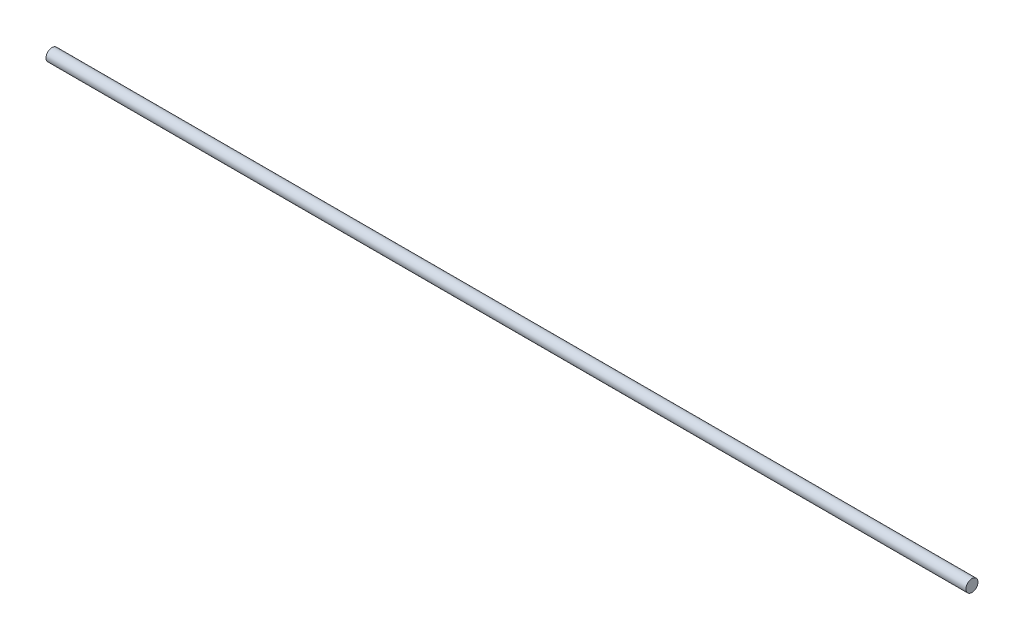
ISO-10303-21;
HEADER;
FILE_DESCRIPTION(('STEP AP214'),'2;1');
FILE_NAME('part.step','',(''),(''),'','','');
FILE_SCHEMA(('AUTOMOTIVE_DESIGN { 1 0 10303 214 1 1 1 1 }'));
ENDSEC;
DATA;
#1=APPLICATION_CONTEXT('core data for automotive mechanical design processes');
#2=APPLICATION_PROTOCOL_DEFINITION('international standard','automotive_design',2000,#1);
#3=PRODUCT_CONTEXT('',#1,'mechanical');
#4=PRODUCT('Part','Part','',(#3));
#5=PRODUCT_RELATED_PRODUCT_CATEGORY('part','',(#4));
#6=PRODUCT_DEFINITION_FORMATION('','',#4);
#7=PRODUCT_DEFINITION_CONTEXT('part definition',#1,'design');
#8=PRODUCT_DEFINITION('design','',#6,#7);
#9=PRODUCT_DEFINITION_SHAPE('','',#8);
#10=(LENGTH_UNIT() NAMED_UNIT(*) SI_UNIT(.MILLI.,.METRE.));
#11=(NAMED_UNIT(*) PLANE_ANGLE_UNIT() SI_UNIT($,.RADIAN.));
#12=(NAMED_UNIT(*) SI_UNIT($,.STERADIAN.) SOLID_ANGLE_UNIT());
#13=UNCERTAINTY_MEASURE_WITH_UNIT(LENGTH_MEASURE(1.E-05),#10,'distance_accuracy_value','');
#14=(GEOMETRIC_REPRESENTATION_CONTEXT(3) GLOBAL_UNCERTAINTY_ASSIGNED_CONTEXT((#13)) GLOBAL_UNIT_ASSIGNED_CONTEXT((#10,
#11,#12)) REPRESENTATION_CONTEXT('',''));
#15=CARTESIAN_POINT('',(0.,0.,0.));
#16=DIRECTION('',(0.,0.,1.));
#17=DIRECTION('',(1.,0.,0.));
#18=AXIS2_PLACEMENT_3D('',#15,#16,#17);
#19=CARTESIAN_POINT('',(241.3,0.,0.));
#20=DIRECTION('',(1.,0.,0.));
#21=DIRECTION('',(0.,0.,-1.));
#22=AXIS2_PLACEMENT_3D('',#19,#20,#21);
#23=PLANE('',#22);
#24=CARTESIAN_POINT('',(241.3,0.,0.));
#25=DIRECTION('',(1.,0.,0.));
#26=DIRECTION('',(0.,0.,-1.));
#27=AXIS2_PLACEMENT_3D('',#24,#25,#26);
#28=CIRCLE('',#27,3.175);
#29=CARTESIAN_POINT('',(241.3,0.,-3.175));
#30=VERTEX_POINT('',#29);
#31=EDGE_CURVE('E17',#30,#30,#28,.F.);
#32=ORIENTED_EDGE('',*,*,#31,.F.);
#33=EDGE_LOOP('',(#32));
#34=FACE_BOUND('',#33,.T.);
#35=ADVANCED_FACE('F14',(#34),#23,.T.);
#36=CARTESIAN_POINT('',(-241.3,0.,0.));
#37=DIRECTION('',(1.,0.,0.));
#38=DIRECTION('',(0.,0.,-1.));
#39=AXIS2_PLACEMENT_3D('',#36,#37,#38);
#40=PLANE('',#39);
#41=CARTESIAN_POINT('',(-241.3,0.,0.));
#42=DIRECTION('',(1.,0.,0.));
#43=DIRECTION('',(0.,0.,-1.));
#44=AXIS2_PLACEMENT_3D('',#41,#42,#43);
#45=CIRCLE('',#44,3.175);
#46=CARTESIAN_POINT('',(-241.3,0.,-3.175));
#47=VERTEX_POINT('',#46);
#48=EDGE_CURVE('E10',#47,#47,#45,.T.);
#49=ORIENTED_EDGE('',*,*,#48,.F.);
#50=EDGE_LOOP('',(#49));
#51=FACE_BOUND('',#50,.T.);
#52=ADVANCED_FACE('F29',(#51),#40,.F.);
#53=CARTESIAN_POINT('',(-241.3,0.,0.));
#54=DIRECTION('',(1.,0.,0.));
#55=DIRECTION('',(0.,0.,-1.));
#56=AXIS2_PLACEMENT_3D('',#53,#54,#55);
#57=CYLINDRICAL_SURFACE('',#56,3.175);
#58=ORIENTED_EDGE('',*,*,#31,.T.);
#59=EDGE_LOOP('',(#58));
#60=FACE_BOUND('',#59,.T.);
#61=ORIENTED_EDGE('',*,*,#48,.T.);
#62=EDGE_LOOP('',(#61));
#63=FACE_BOUND('',#62,.T.);
#64=ADVANCED_FACE('F26',(#60,#63),#57,.T.);
#65=CLOSED_SHELL('',(#35,#52,#64));
#66=MANIFOLD_SOLID_BREP('B1',#65);
#67=ADVANCED_BREP_SHAPE_REPRESENTATION('',(#18,#66),#14);
#68=SHAPE_DEFINITION_REPRESENTATION(#9,#67);
ENDSEC;
END-ISO-10303-21;
